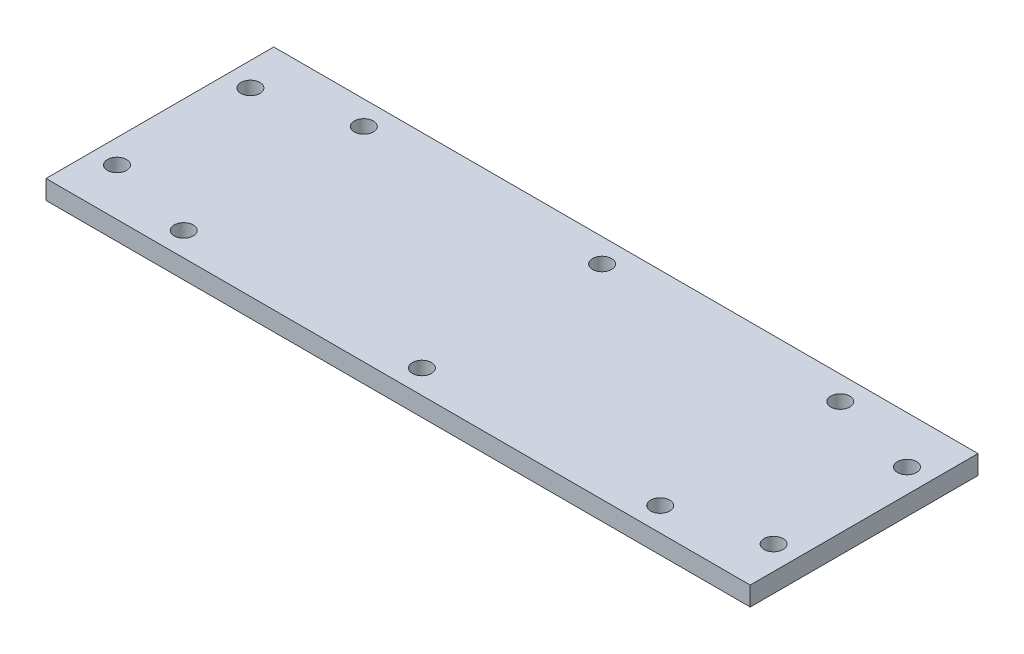
ISO-10303-21;
HEADER;
FILE_DESCRIPTION(('STEP AP214'),'2;1');
FILE_NAME('part.step','',(''),(''),'','','');
FILE_SCHEMA(('AUTOMOTIVE_DESIGN { 1 0 10303 214 1 1 1 1 }'));
ENDSEC;
DATA;
#1=APPLICATION_CONTEXT('core data for automotive mechanical design processes');
#2=APPLICATION_PROTOCOL_DEFINITION('international standard','automotive_design',2000,#1);
#3=PRODUCT_CONTEXT('',#1,'mechanical');
#4=PRODUCT('Part','Part','',(#3));
#5=PRODUCT_RELATED_PRODUCT_CATEGORY('part','',(#4));
#6=PRODUCT_DEFINITION_FORMATION('','',#4);
#7=PRODUCT_DEFINITION_CONTEXT('part definition',#1,'design');
#8=PRODUCT_DEFINITION('design','',#6,#7);
#9=PRODUCT_DEFINITION_SHAPE('','',#8);
#10=(LENGTH_UNIT() NAMED_UNIT(*) SI_UNIT(.MILLI.,.METRE.));
#11=(NAMED_UNIT(*) PLANE_ANGLE_UNIT() SI_UNIT($,.RADIAN.));
#12=(NAMED_UNIT(*) SI_UNIT($,.STERADIAN.) SOLID_ANGLE_UNIT());
#13=UNCERTAINTY_MEASURE_WITH_UNIT(LENGTH_MEASURE(1.E-05),#10,'distance_accuracy_value','');
#14=(GEOMETRIC_REPRESENTATION_CONTEXT(3) GLOBAL_UNCERTAINTY_ASSIGNED_CONTEXT((#13)) GLOBAL_UNIT_ASSIGNED_CONTEXT((#10,
#11,#12)) REPRESENTATION_CONTEXT('',''));
#15=CARTESIAN_POINT('',(0.,0.,0.));
#16=DIRECTION('',(0.,0.,1.));
#17=DIRECTION('',(1.,0.,0.));
#18=AXIS2_PLACEMENT_3D('',#15,#16,#17);
#19=CARTESIAN_POINT('',(0.,2.,0.));
#20=DIRECTION('',(0.,-1.,0.));
#21=DIRECTION('',(0.,0.,-1.));
#22=AXIS2_PLACEMENT_3D('',#19,#20,#21);
#23=PLANE('',#22);
#24=DIRECTION('',(0.,0.,-1.));
#25=VECTOR('',#24,1.);
#26=CARTESIAN_POINT('',(36.95,2.,11.95));
#27=LINE('',#26,#25);
#28=CARTESIAN_POINT('',(36.95,2.,11.95));
#29=VERTEX_POINT('',#28);
#30=CARTESIAN_POINT('',(36.95,2.,-11.95));
#31=VERTEX_POINT('',#30);
#32=EDGE_CURVE('E92',#29,#31,#27,.T.);
#33=ORIENTED_EDGE('',*,*,#32,.T.);
#34=DIRECTION('',(-1.,0.,0.));
#35=VECTOR('',#34,1.);
#36=CARTESIAN_POINT('',(-36.95,2.,-11.95));
#37=LINE('',#36,#35);
#38=CARTESIAN_POINT('',(-36.95,2.,-11.95));
#39=VERTEX_POINT('',#38);
#40=EDGE_CURVE('E87',#31,#39,#37,.T.);
#41=ORIENTED_EDGE('',*,*,#40,.T.);
#42=DIRECTION('',(0.,0.,1.));
#43=VECTOR('',#42,1.);
#44=CARTESIAN_POINT('',(-36.95,2.,11.95));
#45=LINE('',#44,#43);
#46=CARTESIAN_POINT('',(-36.95,2.,11.95));
#47=VERTEX_POINT('',#46);
#48=EDGE_CURVE('E90',#39,#47,#45,.T.);
#49=ORIENTED_EDGE('',*,*,#48,.T.);
#50=DIRECTION('',(1.,0.,0.));
#51=VECTOR('',#50,1.);
#52=CARTESIAN_POINT('',(-36.95,2.,11.95));
#53=LINE('',#52,#51);
#54=EDGE_CURVE('E57',#47,#29,#53,.T.);
#55=ORIENTED_EDGE('',*,*,#54,.T.);
#56=EDGE_LOOP('',(#33,#41,#49,#55));
#57=FACE_BOUND('',#56,.T.);
#58=CARTESIAN_POINT('',(-25.,2.,-9.45));
#59=DIRECTION('',(0.,1.,0.));
#60=DIRECTION('',(0.,0.,1.));
#61=AXIS2_PLACEMENT_3D('',#58,#59,#60);
#62=CIRCLE('',#61,1.);
#63=CARTESIAN_POINT('',(-25.,2.,-8.45));
#64=VERTEX_POINT('',#63);
#65=EDGE_CURVE('E112',#64,#64,#62,.T.);
#66=ORIENTED_EDGE('',*,*,#65,.F.);
#67=EDGE_LOOP('',(#66));
#68=FACE_BOUND('',#67,.T.);
#69=CARTESIAN_POINT('',(0.,2.,-9.45));
#70=DIRECTION('',(0.,1.,0.));
#71=DIRECTION('',(0.,0.,1.));
#72=AXIS2_PLACEMENT_3D('',#69,#70,#71);
#73=CIRCLE('',#72,1.);
#74=CARTESIAN_POINT('',(0.,2.,-8.45));
#75=VERTEX_POINT('',#74);
#76=EDGE_CURVE('E134',#75,#75,#73,.T.);
#77=ORIENTED_EDGE('',*,*,#76,.F.);
#78=EDGE_LOOP('',(#77));
#79=FACE_BOUND('',#78,.T.);
#80=CARTESIAN_POINT('',(25.,2.,-9.45));
#81=DIRECTION('',(0.,1.,0.));
#82=DIRECTION('',(0.,0.,1.));
#83=AXIS2_PLACEMENT_3D('',#80,#81,#82);
#84=CIRCLE('',#83,1.);
#85=CARTESIAN_POINT('',(25.,2.,-8.45));
#86=VERTEX_POINT('',#85);
#87=EDGE_CURVE('E142',#86,#86,#84,.T.);
#88=ORIENTED_EDGE('',*,*,#87,.F.);
#89=EDGE_LOOP('',(#88));
#90=FACE_BOUND('',#89,.T.);
#91=CARTESIAN_POINT('',(-34.45,2.,-7.));
#92=DIRECTION('',(0.,1.,0.));
#93=DIRECTION('',(0.,0.,1.));
#94=AXIS2_PLACEMENT_3D('',#91,#92,#93);
#95=CIRCLE('',#94,0.999999999999998);
#96=CARTESIAN_POINT('',(-34.45,2.,-6.));
#97=VERTEX_POINT('',#96);
#98=EDGE_CURVE('E150',#97,#97,#95,.T.);
#99=ORIENTED_EDGE('',*,*,#98,.F.);
#100=EDGE_LOOP('',(#99));
#101=FACE_BOUND('',#100,.T.);
#102=CARTESIAN_POINT('',(25.,2.,9.45));
#103=DIRECTION('',(0.,1.,0.));
#104=DIRECTION('',(0.,0.,-1.));
#105=AXIS2_PLACEMENT_3D('',#102,#103,#104);
#106=CIRCLE('',#105,1.);
#107=CARTESIAN_POINT('',(25.,2.,8.45));
#108=VERTEX_POINT('',#107);
#109=EDGE_CURVE('E158',#108,#108,#106,.T.);
#110=ORIENTED_EDGE('',*,*,#109,.F.);
#111=EDGE_LOOP('',(#110));
#112=FACE_BOUND('',#111,.T.);
#113=CARTESIAN_POINT('',(0.,2.,9.45));
#114=DIRECTION('',(0.,1.,0.));
#115=DIRECTION('',(0.,0.,-1.));
#116=AXIS2_PLACEMENT_3D('',#113,#114,#115);
#117=CIRCLE('',#116,1.);
#118=CARTESIAN_POINT('',(0.,2.,8.45));
#119=VERTEX_POINT('',#118);
#120=EDGE_CURVE('E166',#119,#119,#117,.T.);
#121=ORIENTED_EDGE('',*,*,#120,.F.);
#122=EDGE_LOOP('',(#121));
#123=FACE_BOUND('',#122,.T.);
#124=CARTESIAN_POINT('',(-25.,2.,9.45));
#125=DIRECTION('',(0.,1.,0.));
#126=DIRECTION('',(0.,0.,-1.));
#127=AXIS2_PLACEMENT_3D('',#124,#125,#126);
#128=CIRCLE('',#127,1.);
#129=CARTESIAN_POINT('',(-25.,2.,8.45));
#130=VERTEX_POINT('',#129);
#131=EDGE_CURVE('E174',#130,#130,#128,.T.);
#132=ORIENTED_EDGE('',*,*,#131,.F.);
#133=EDGE_LOOP('',(#132));
#134=FACE_BOUND('',#133,.T.);
#135=CARTESIAN_POINT('',(-34.45,2.,7.));
#136=DIRECTION('',(0.,1.,0.));
#137=DIRECTION('',(0.,0.,-1.));
#138=AXIS2_PLACEMENT_3D('',#135,#136,#137);
#139=CIRCLE('',#138,0.999999999999998);
#140=CARTESIAN_POINT('',(-34.45,2.,6.00000000000001));
#141=VERTEX_POINT('',#140);
#142=EDGE_CURVE('E182',#141,#141,#139,.T.);
#143=ORIENTED_EDGE('',*,*,#142,.F.);
#144=EDGE_LOOP('',(#143));
#145=FACE_BOUND('',#144,.T.);
#146=CARTESIAN_POINT('',(34.45,2.,7.));
#147=DIRECTION('',(0.,1.,0.));
#148=DIRECTION('',(0.,0.,1.));
#149=AXIS2_PLACEMENT_3D('',#146,#147,#148);
#150=CIRCLE('',#149,0.999999999999998);
#151=CARTESIAN_POINT('',(34.45,2.,8.));
#152=VERTEX_POINT('',#151);
#153=EDGE_CURVE('E190',#152,#152,#150,.T.);
#154=ORIENTED_EDGE('',*,*,#153,.F.);
#155=EDGE_LOOP('',(#154));
#156=FACE_BOUND('',#155,.T.);
#157=CARTESIAN_POINT('',(34.45,2.,-7.));
#158=DIRECTION('',(0.,1.,0.));
#159=DIRECTION('',(0.,0.,-1.));
#160=AXIS2_PLACEMENT_3D('',#157,#158,#159);
#161=CIRCLE('',#160,0.999999999999998);
#162=CARTESIAN_POINT('',(34.45,2.,-8.));
#163=VERTEX_POINT('',#162);
#164=EDGE_CURVE('E198',#163,#163,#161,.T.);
#165=ORIENTED_EDGE('',*,*,#164,.F.);
#166=EDGE_LOOP('',(#165));
#167=FACE_BOUND('',#166,.T.);
#168=ADVANCED_FACE('F39',(#57,#68,#79,#90,#101,#112,#123,#134,#145,#156,#167),#23,.F.);
#169=CARTESIAN_POINT('',(0.,0.,0.));
#170=DIRECTION('',(0.,-1.,0.));
#171=DIRECTION('',(0.,0.,-1.));
#172=AXIS2_PLACEMENT_3D('',#169,#170,#171);
#173=PLANE('',#172);
#174=CARTESIAN_POINT('',(34.45,0.,7.));
#175=DIRECTION('',(0.,1.,0.));
#176=DIRECTION('',(0.,0.,1.));
#177=AXIS2_PLACEMENT_3D('',#174,#175,#176);
#178=CIRCLE('',#177,0.999999999999998);
#179=CARTESIAN_POINT('',(34.45,0.,8.));
#180=VERTEX_POINT('',#179);
#181=EDGE_CURVE('E194',#180,#180,#178,.T.);
#182=ORIENTED_EDGE('',*,*,#181,.T.);
#183=EDGE_LOOP('',(#182));
#184=FACE_BOUND('',#183,.T.);
#185=CARTESIAN_POINT('',(-25.,0.,9.45));
#186=DIRECTION('',(0.,1.,0.));
#187=DIRECTION('',(0.,0.,-1.));
#188=AXIS2_PLACEMENT_3D('',#185,#186,#187);
#189=CIRCLE('',#188,1.);
#190=CARTESIAN_POINT('',(-25.,0.,8.45));
#191=VERTEX_POINT('',#190);
#192=EDGE_CURVE('E178',#191,#191,#189,.T.);
#193=ORIENTED_EDGE('',*,*,#192,.T.);
#194=EDGE_LOOP('',(#193));
#195=FACE_BOUND('',#194,.T.);
#196=CARTESIAN_POINT('',(25.,0.,9.45));
#197=DIRECTION('',(0.,1.,0.));
#198=DIRECTION('',(0.,0.,-1.));
#199=AXIS2_PLACEMENT_3D('',#196,#197,#198);
#200=CIRCLE('',#199,1.);
#201=CARTESIAN_POINT('',(25.,0.,8.45));
#202=VERTEX_POINT('',#201);
#203=EDGE_CURVE('E162',#202,#202,#200,.T.);
#204=ORIENTED_EDGE('',*,*,#203,.T.);
#205=EDGE_LOOP('',(#204));
#206=FACE_BOUND('',#205,.T.);
#207=CARTESIAN_POINT('',(25.,0.,-9.45));
#208=DIRECTION('',(0.,1.,0.));
#209=DIRECTION('',(0.,0.,1.));
#210=AXIS2_PLACEMENT_3D('',#207,#208,#209);
#211=CIRCLE('',#210,1.);
#212=CARTESIAN_POINT('',(25.,0.,-8.45));
#213=VERTEX_POINT('',#212);
#214=EDGE_CURVE('E146',#213,#213,#211,.T.);
#215=ORIENTED_EDGE('',*,*,#214,.T.);
#216=EDGE_LOOP('',(#215));
#217=FACE_BOUND('',#216,.T.);
#218=CARTESIAN_POINT('',(-25.,0.,-9.45));
#219=DIRECTION('',(0.,1.,0.));
#220=DIRECTION('',(0.,0.,1.));
#221=AXIS2_PLACEMENT_3D('',#218,#219,#220);
#222=CIRCLE('',#221,1.);
#223=CARTESIAN_POINT('',(-25.,0.,-8.45));
#224=VERTEX_POINT('',#223);
#225=EDGE_CURVE('E130',#224,#224,#222,.T.);
#226=ORIENTED_EDGE('',*,*,#225,.T.);
#227=EDGE_LOOP('',(#226));
#228=FACE_BOUND('',#227,.T.);
#229=DIRECTION('',(0.,0.,-1.));
#230=VECTOR('',#229,1.);
#231=CARTESIAN_POINT('',(36.95,0.,11.95));
#232=LINE('',#231,#230);
#233=CARTESIAN_POINT('',(36.95,0.,11.95));
#234=VERTEX_POINT('',#233);
#235=CARTESIAN_POINT('',(36.95,0.,-11.95));
#236=VERTEX_POINT('',#235);
#237=EDGE_CURVE('E108',#234,#236,#232,.T.);
#238=ORIENTED_EDGE('',*,*,#237,.F.);
#239=DIRECTION('',(1.,0.,0.));
#240=VECTOR('',#239,1.);
#241=CARTESIAN_POINT('',(-36.95,0.,11.95));
#242=LINE('',#241,#240);
#243=CARTESIAN_POINT('',(-36.95,0.,11.95));
#244=VERTEX_POINT('',#243);
#245=EDGE_CURVE('E80',#244,#234,#242,.T.);
#246=ORIENTED_EDGE('',*,*,#245,.F.);
#247=DIRECTION('',(0.,0.,1.));
#248=VECTOR('',#247,1.);
#249=CARTESIAN_POINT('',(-36.95,0.,11.95));
#250=LINE('',#249,#248);
#251=CARTESIAN_POINT('',(-36.95,0.,-11.95));
#252=VERTEX_POINT('',#251);
#253=EDGE_CURVE('E74',#252,#244,#250,.T.);
#254=ORIENTED_EDGE('',*,*,#253,.F.);
#255=DIRECTION('',(-1.,0.,0.));
#256=VECTOR('',#255,1.);
#257=CARTESIAN_POINT('',(-36.95,0.,-11.95));
#258=LINE('',#257,#256);
#259=EDGE_CURVE('E97',#236,#252,#258,.T.);
#260=ORIENTED_EDGE('',*,*,#259,.F.);
#261=EDGE_LOOP('',(#238,#246,#254,#260));
#262=FACE_BOUND('',#261,.T.);
#263=CARTESIAN_POINT('',(0.,0.,-9.45));
#264=DIRECTION('',(0.,1.,0.));
#265=DIRECTION('',(0.,0.,1.));
#266=AXIS2_PLACEMENT_3D('',#263,#264,#265);
#267=CIRCLE('',#266,1.);
#268=CARTESIAN_POINT('',(0.,0.,-8.45));
#269=VERTEX_POINT('',#268);
#270=EDGE_CURVE('E138',#269,#269,#267,.T.);
#271=ORIENTED_EDGE('',*,*,#270,.T.);
#272=EDGE_LOOP('',(#271));
#273=FACE_BOUND('',#272,.T.);
#274=CARTESIAN_POINT('',(-34.45,0.,-7.));
#275=DIRECTION('',(0.,1.,0.));
#276=DIRECTION('',(0.,0.,1.));
#277=AXIS2_PLACEMENT_3D('',#274,#275,#276);
#278=CIRCLE('',#277,0.999999999999998);
#279=CARTESIAN_POINT('',(-34.45,0.,-6.));
#280=VERTEX_POINT('',#279);
#281=EDGE_CURVE('E154',#280,#280,#278,.T.);
#282=ORIENTED_EDGE('',*,*,#281,.T.);
#283=EDGE_LOOP('',(#282));
#284=FACE_BOUND('',#283,.T.);
#285=CARTESIAN_POINT('',(0.,0.,9.45));
#286=DIRECTION('',(0.,1.,0.));
#287=DIRECTION('',(0.,0.,-1.));
#288=AXIS2_PLACEMENT_3D('',#285,#286,#287);
#289=CIRCLE('',#288,1.);
#290=CARTESIAN_POINT('',(0.,0.,8.45));
#291=VERTEX_POINT('',#290);
#292=EDGE_CURVE('E170',#291,#291,#289,.T.);
#293=ORIENTED_EDGE('',*,*,#292,.T.);
#294=EDGE_LOOP('',(#293));
#295=FACE_BOUND('',#294,.T.);
#296=CARTESIAN_POINT('',(-34.45,0.,7.));
#297=DIRECTION('',(0.,1.,0.));
#298=DIRECTION('',(0.,0.,-1.));
#299=AXIS2_PLACEMENT_3D('',#296,#297,#298);
#300=CIRCLE('',#299,0.999999999999998);
#301=CARTESIAN_POINT('',(-34.45,0.,6.00000000000001));
#302=VERTEX_POINT('',#301);
#303=EDGE_CURVE('E186',#302,#302,#300,.T.);
#304=ORIENTED_EDGE('',*,*,#303,.T.);
#305=EDGE_LOOP('',(#304));
#306=FACE_BOUND('',#305,.T.);
#307=CARTESIAN_POINT('',(34.45,0.,-7.));
#308=DIRECTION('',(0.,1.,0.));
#309=DIRECTION('',(0.,0.,-1.));
#310=AXIS2_PLACEMENT_3D('',#307,#308,#309);
#311=CIRCLE('',#310,0.999999999999998);
#312=CARTESIAN_POINT('',(34.45,0.,-8.));
#313=VERTEX_POINT('',#312);
#314=EDGE_CURVE('E202',#313,#313,#311,.T.);
#315=ORIENTED_EDGE('',*,*,#314,.T.);
#316=EDGE_LOOP('',(#315));
#317=FACE_BOUND('',#316,.T.);
#318=ADVANCED_FACE('F125',(#184,#195,#206,#217,#228,#262,#273,#284,#295,#306,#317),#173,.T.);
#319=CARTESIAN_POINT('',(36.95,2.,11.95));
#320=DIRECTION('',(-1.,0.,0.));
#321=DIRECTION('',(0.,0.,1.));
#322=AXIS2_PLACEMENT_3D('',#319,#320,#321);
#323=PLANE('',#322);
#324=ORIENTED_EDGE('',*,*,#237,.T.);
#325=DIRECTION('',(0.,-1.,0.));
#326=VECTOR('',#325,1.);
#327=CARTESIAN_POINT('',(36.95,2.,-11.95));
#328=LINE('',#327,#326);
#329=EDGE_CURVE('E11',#31,#236,#328,.T.);
#330=ORIENTED_EDGE('',*,*,#329,.F.);
#331=ORIENTED_EDGE('',*,*,#32,.F.);
#332=DIRECTION('',(0.,-1.,0.));
#333=VECTOR('',#332,1.);
#334=CARTESIAN_POINT('',(36.95,2.,11.95));
#335=LINE('',#334,#333);
#336=EDGE_CURVE('E104',#29,#234,#335,.T.);
#337=ORIENTED_EDGE('',*,*,#336,.T.);
#338=EDGE_LOOP('',(#324,#330,#331,#337));
#339=FACE_BOUND('',#338,.T.);
#340=ADVANCED_FACE('F41',(#339),#323,.F.);
#341=CARTESIAN_POINT('',(-36.95,2.,-11.95));
#342=DIRECTION('',(0.,0.,1.));
#343=DIRECTION('',(1.,0.,0.));
#344=AXIS2_PLACEMENT_3D('',#341,#342,#343);
#345=PLANE('',#344);
#346=ORIENTED_EDGE('',*,*,#259,.T.);
#347=DIRECTION('',(0.,-1.,0.));
#348=VECTOR('',#347,1.);
#349=CARTESIAN_POINT('',(-36.95,2.,-11.95));
#350=LINE('',#349,#348);
#351=EDGE_CURVE('E49',#39,#252,#350,.T.);
#352=ORIENTED_EDGE('',*,*,#351,.F.);
#353=ORIENTED_EDGE('',*,*,#40,.F.);
#354=ORIENTED_EDGE('',*,*,#329,.T.);
#355=EDGE_LOOP('',(#346,#352,#353,#354));
#356=FACE_BOUND('',#355,.T.);
#357=ADVANCED_FACE('F96',(#356),#345,.F.);
#358=CARTESIAN_POINT('',(-36.95,2.,11.95));
#359=DIRECTION('',(1.,0.,0.));
#360=DIRECTION('',(0.,0.,-1.));
#361=AXIS2_PLACEMENT_3D('',#358,#359,#360);
#362=PLANE('',#361);
#363=ORIENTED_EDGE('',*,*,#253,.T.);
#364=DIRECTION('',(0.,-1.,0.));
#365=VECTOR('',#364,1.);
#366=CARTESIAN_POINT('',(-36.95,2.,11.95));
#367=LINE('',#366,#365);
#368=EDGE_CURVE('E99',#47,#244,#367,.T.);
#369=ORIENTED_EDGE('',*,*,#368,.F.);
#370=ORIENTED_EDGE('',*,*,#48,.F.);
#371=ORIENTED_EDGE('',*,*,#351,.T.);
#372=EDGE_LOOP('',(#363,#369,#370,#371));
#373=FACE_BOUND('',#372,.T.);
#374=ADVANCED_FACE('F100',(#373),#362,.F.);
#375=CARTESIAN_POINT('',(-36.95,2.,11.95));
#376=DIRECTION('',(0.,0.,-1.));
#377=DIRECTION('',(-1.,0.,0.));
#378=AXIS2_PLACEMENT_3D('',#375,#376,#377);
#379=PLANE('',#378);
#380=ORIENTED_EDGE('',*,*,#245,.T.);
#381=ORIENTED_EDGE('',*,*,#336,.F.);
#382=ORIENTED_EDGE('',*,*,#54,.F.);
#383=ORIENTED_EDGE('',*,*,#368,.T.);
#384=EDGE_LOOP('',(#380,#381,#382,#383));
#385=FACE_BOUND('',#384,.T.);
#386=ADVANCED_FACE('F122',(#385),#379,.F.);
#387=CARTESIAN_POINT('',(-25.,2.,-9.45));
#388=DIRECTION('',(0.,-1.,0.));
#389=DIRECTION('',(0.,0.,-1.));
#390=AXIS2_PLACEMENT_3D('',#387,#388,#389);
#391=CYLINDRICAL_SURFACE('',#390,1.);
#392=ORIENTED_EDGE('',*,*,#65,.T.);
#393=EDGE_LOOP('',(#392));
#394=FACE_BOUND('',#393,.T.);
#395=ORIENTED_EDGE('',*,*,#225,.F.);
#396=EDGE_LOOP('',(#395));
#397=FACE_BOUND('',#396,.T.);
#398=ADVANCED_FACE('F221',(#394,#397),#391,.F.);
#399=CARTESIAN_POINT('',(0.,2.,-9.45));
#400=DIRECTION('',(0.,-1.,0.));
#401=DIRECTION('',(0.,0.,-1.));
#402=AXIS2_PLACEMENT_3D('',#399,#400,#401);
#403=CYLINDRICAL_SURFACE('',#402,1.);
#404=ORIENTED_EDGE('',*,*,#76,.T.);
#405=EDGE_LOOP('',(#404));
#406=FACE_BOUND('',#405,.T.);
#407=ORIENTED_EDGE('',*,*,#270,.F.);
#408=EDGE_LOOP('',(#407));
#409=FACE_BOUND('',#408,.T.);
#410=ADVANCED_FACE('F267',(#406,#409),#403,.F.);
#411=CARTESIAN_POINT('',(25.,2.,-9.45));
#412=DIRECTION('',(0.,-1.,0.));
#413=DIRECTION('',(0.,0.,-1.));
#414=AXIS2_PLACEMENT_3D('',#411,#412,#413);
#415=CYLINDRICAL_SURFACE('',#414,1.);
#416=ORIENTED_EDGE('',*,*,#87,.T.);
#417=EDGE_LOOP('',(#416));
#418=FACE_BOUND('',#417,.T.);
#419=ORIENTED_EDGE('',*,*,#214,.F.);
#420=EDGE_LOOP('',(#419));
#421=FACE_BOUND('',#420,.T.);
#422=ADVANCED_FACE('F275',(#418,#421),#415,.F.);
#423=CARTESIAN_POINT('',(-34.45,2.,-7.));
#424=DIRECTION('',(0.,-1.,0.));
#425=DIRECTION('',(0.,0.,-1.));
#426=AXIS2_PLACEMENT_3D('',#423,#424,#425);
#427=CYLINDRICAL_SURFACE('',#426,0.999999999999998);
#428=ORIENTED_EDGE('',*,*,#98,.T.);
#429=EDGE_LOOP('',(#428));
#430=FACE_BOUND('',#429,.T.);
#431=ORIENTED_EDGE('',*,*,#281,.F.);
#432=EDGE_LOOP('',(#431));
#433=FACE_BOUND('',#432,.T.);
#434=ADVANCED_FACE('F283',(#430,#433),#427,.F.);
#435=CARTESIAN_POINT('',(25.,2.,9.45));
#436=DIRECTION('',(0.,-1.,0.));
#437=DIRECTION('',(0.,0.,-1.));
#438=AXIS2_PLACEMENT_3D('',#435,#436,#437);
#439=CYLINDRICAL_SURFACE('',#438,1.);
#440=ORIENTED_EDGE('',*,*,#109,.T.);
#441=EDGE_LOOP('',(#440));
#442=FACE_BOUND('',#441,.T.);
#443=ORIENTED_EDGE('',*,*,#203,.F.);
#444=EDGE_LOOP('',(#443));
#445=FACE_BOUND('',#444,.T.);
#446=ADVANCED_FACE('F292',(#442,#445),#439,.F.);
#447=CARTESIAN_POINT('',(0.,2.,9.45));
#448=DIRECTION('',(0.,-1.,0.));
#449=DIRECTION('',(0.,0.,-1.));
#450=AXIS2_PLACEMENT_3D('',#447,#448,#449);
#451=CYLINDRICAL_SURFACE('',#450,1.);
#452=ORIENTED_EDGE('',*,*,#120,.T.);
#453=EDGE_LOOP('',(#452));
#454=FACE_BOUND('',#453,.T.);
#455=ORIENTED_EDGE('',*,*,#292,.F.);
#456=EDGE_LOOP('',(#455));
#457=FACE_BOUND('',#456,.T.);
#458=ADVANCED_FACE('F301',(#454,#457),#451,.F.);
#459=CARTESIAN_POINT('',(-25.,2.,9.45));
#460=DIRECTION('',(0.,-1.,0.));
#461=DIRECTION('',(0.,0.,-1.));
#462=AXIS2_PLACEMENT_3D('',#459,#460,#461);
#463=CYLINDRICAL_SURFACE('',#462,1.);
#464=ORIENTED_EDGE('',*,*,#131,.T.);
#465=EDGE_LOOP('',(#464));
#466=FACE_BOUND('',#465,.T.);
#467=ORIENTED_EDGE('',*,*,#192,.F.);
#468=EDGE_LOOP('',(#467));
#469=FACE_BOUND('',#468,.T.);
#470=ADVANCED_FACE('F310',(#466,#469),#463,.F.);
#471=CARTESIAN_POINT('',(-34.45,2.,7.));
#472=DIRECTION('',(0.,-1.,0.));
#473=DIRECTION('',(0.,0.,-1.));
#474=AXIS2_PLACEMENT_3D('',#471,#472,#473);
#475=CYLINDRICAL_SURFACE('',#474,0.999999999999998);
#476=ORIENTED_EDGE('',*,*,#142,.T.);
#477=EDGE_LOOP('',(#476));
#478=FACE_BOUND('',#477,.T.);
#479=ORIENTED_EDGE('',*,*,#303,.F.);
#480=EDGE_LOOP('',(#479));
#481=FACE_BOUND('',#480,.T.);
#482=ADVANCED_FACE('F319',(#478,#481),#475,.F.);
#483=CARTESIAN_POINT('',(34.45,2.,7.));
#484=DIRECTION('',(0.,-1.,0.));
#485=DIRECTION('',(0.,0.,-1.));
#486=AXIS2_PLACEMENT_3D('',#483,#484,#485);
#487=CYLINDRICAL_SURFACE('',#486,0.999999999999998);
#488=ORIENTED_EDGE('',*,*,#153,.T.);
#489=EDGE_LOOP('',(#488));
#490=FACE_BOUND('',#489,.T.);
#491=ORIENTED_EDGE('',*,*,#181,.F.);
#492=EDGE_LOOP('',(#491));
#493=FACE_BOUND('',#492,.T.);
#494=ADVANCED_FACE('F328',(#490,#493),#487,.F.);
#495=CARTESIAN_POINT('',(34.45,2.,-7.));
#496=DIRECTION('',(0.,-1.,0.));
#497=DIRECTION('',(0.,0.,-1.));
#498=AXIS2_PLACEMENT_3D('',#495,#496,#497);
#499=CYLINDRICAL_SURFACE('',#498,0.999999999999998);
#500=ORIENTED_EDGE('',*,*,#164,.T.);
#501=EDGE_LOOP('',(#500));
#502=FACE_BOUND('',#501,.T.);
#503=ORIENTED_EDGE('',*,*,#314,.F.);
#504=EDGE_LOOP('',(#503));
#505=FACE_BOUND('',#504,.T.);
#506=ADVANCED_FACE('F210',(#502,#505),#499,.F.);
#507=CLOSED_SHELL('',(#168,#318,#340,#357,#374,#386,#398,#410,#422,#434,#446,#458,#470,#482,
#494,#506));
#508=MANIFOLD_SOLID_BREP('B2',#507);
#509=ADVANCED_BREP_SHAPE_REPRESENTATION('',(#18,#508),#14);
#510=SHAPE_DEFINITION_REPRESENTATION(#9,#509);
ENDSEC;
END-ISO-10303-21;
